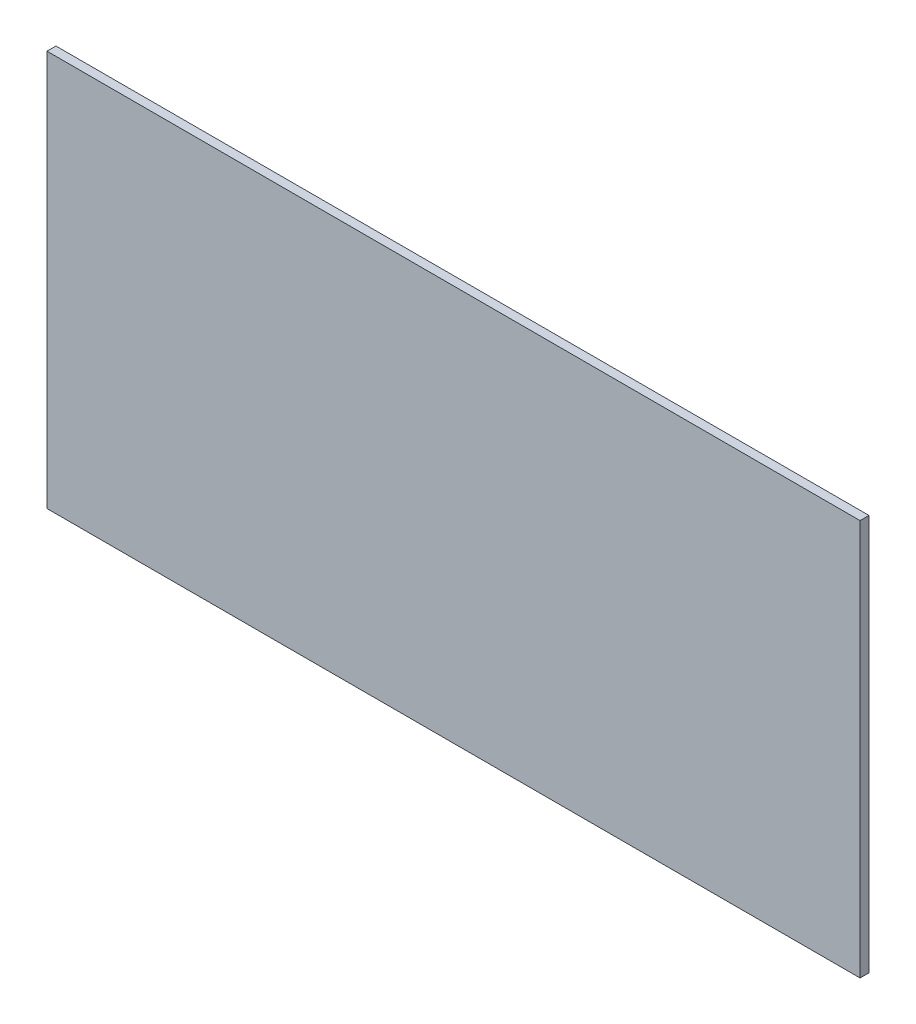
ISO-10303-21;
HEADER;
FILE_DESCRIPTION(('STEP AP214'),'2;1');
FILE_NAME('part.step','',(''),(''),'','','');
FILE_SCHEMA(('AUTOMOTIVE_DESIGN { 1 0 10303 214 1 1 1 1 }'));
ENDSEC;
DATA;
#1=APPLICATION_CONTEXT('core data for automotive mechanical design processes');
#2=APPLICATION_PROTOCOL_DEFINITION('international standard','automotive_design',2000,#1);
#3=PRODUCT_CONTEXT('',#1,'mechanical');
#4=PRODUCT('Part','Part','',(#3));
#5=PRODUCT_RELATED_PRODUCT_CATEGORY('part','',(#4));
#6=PRODUCT_DEFINITION_FORMATION('','',#4);
#7=PRODUCT_DEFINITION_CONTEXT('part definition',#1,'design');
#8=PRODUCT_DEFINITION('design','',#6,#7);
#9=PRODUCT_DEFINITION_SHAPE('','',#8);
#10=(LENGTH_UNIT() NAMED_UNIT(*) SI_UNIT(.MILLI.,.METRE.));
#11=(NAMED_UNIT(*) PLANE_ANGLE_UNIT() SI_UNIT($,.RADIAN.));
#12=(NAMED_UNIT(*) SI_UNIT($,.STERADIAN.) SOLID_ANGLE_UNIT());
#13=UNCERTAINTY_MEASURE_WITH_UNIT(LENGTH_MEASURE(1.E-05),#10,'distance_accuracy_value','');
#14=(GEOMETRIC_REPRESENTATION_CONTEXT(3) GLOBAL_UNCERTAINTY_ASSIGNED_CONTEXT((#13)) GLOBAL_UNIT_ASSIGNED_CONTEXT((#10,
#11,#12)) REPRESENTATION_CONTEXT('',''));
#15=CARTESIAN_POINT('',(0.,0.,0.));
#16=DIRECTION('',(0.,0.,1.));
#17=DIRECTION('',(1.,0.,0.));
#18=AXIS2_PLACEMENT_3D('',#15,#16,#17);
#19=CARTESIAN_POINT('',(-38.0756761891247,29.0300735585592,3.));
#20=DIRECTION('',(1.,0.,0.));
#21=DIRECTION('',(0.,1.,0.));
#22=AXIS2_PLACEMENT_3D('',#19,#20,#21);
#23=PLANE('',#22);
#24=DIRECTION('',(0.,-1.,0.));
#25=VECTOR('',#24,1.);
#26=CARTESIAN_POINT('',(-38.0756761891247,29.0300735585592,0.));
#27=LINE('',#26,#25);
#28=CARTESIAN_POINT('',(-38.0756761891247,29.0300735585592,0.));
#29=VERTEX_POINT('',#28);
#30=CARTESIAN_POINT('',(-38.0756761891247,-103.969926441441,0.));
#31=VERTEX_POINT('',#30);
#32=EDGE_CURVE('E96',#29,#31,#27,.T.);
#33=ORIENTED_EDGE('',*,*,#32,.T.);
#34=DIRECTION('',(0.,0.,-1.));
#35=VECTOR('',#34,1.);
#36=CARTESIAN_POINT('',(-38.0756761891247,-103.969926441441,3.));
#37=LINE('',#36,#35);
#38=CARTESIAN_POINT('',(-38.0756761891247,-103.969926441441,3.));
#39=VERTEX_POINT('',#38);
#40=EDGE_CURVE('E11',#39,#31,#37,.T.);
#41=ORIENTED_EDGE('',*,*,#40,.F.);
#42=DIRECTION('',(0.,-1.,0.));
#43=VECTOR('',#42,1.);
#44=CARTESIAN_POINT('',(-38.0756761891247,29.0300735585592,3.));
#45=LINE('',#44,#43);
#46=CARTESIAN_POINT('',(-38.0756761891247,29.0300735585592,3.));
#47=VERTEX_POINT('',#46);
#48=EDGE_CURVE('E84',#47,#39,#45,.T.);
#49=ORIENTED_EDGE('',*,*,#48,.F.);
#50=DIRECTION('',(0.,0.,-1.));
#51=VECTOR('',#50,1.);
#52=CARTESIAN_POINT('',(-38.0756761891247,29.0300735585592,3.));
#53=LINE('',#52,#51);
#54=EDGE_CURVE('E92',#47,#29,#53,.T.);
#55=ORIENTED_EDGE('',*,*,#54,.T.);
#56=EDGE_LOOP('',(#33,#41,#49,#55));
#57=FACE_BOUND('',#56,.T.);
#58=ADVANCED_FACE('F33',(#57),#23,.F.);
#59=CARTESIAN_POINT('',(-38.0756761891247,-103.969926441441,3.));
#60=DIRECTION('',(0.,1.,0.));
#61=DIRECTION('',(0.,0.,1.));
#62=AXIS2_PLACEMENT_3D('',#59,#60,#61);
#63=PLANE('',#62);
#64=DIRECTION('',(1.,0.,0.));
#65=VECTOR('',#64,1.);
#66=CARTESIAN_POINT('',(-38.0756761891247,-103.969926441441,0.));
#67=LINE('',#66,#65);
#68=CARTESIAN_POINT('',(234.924323810875,-103.969926441441,0.));
#69=VERTEX_POINT('',#68);
#70=EDGE_CURVE('E88',#31,#69,#67,.T.);
#71=ORIENTED_EDGE('',*,*,#70,.T.);
#72=DIRECTION('',(0.,0.,-1.));
#73=VECTOR('',#72,1.);
#74=CARTESIAN_POINT('',(234.924323810875,-103.969926441441,3.));
#75=LINE('',#74,#73);
#76=CARTESIAN_POINT('',(234.924323810875,-103.969926441441,3.));
#77=VERTEX_POINT('',#76);
#78=EDGE_CURVE('E41',#77,#69,#75,.T.);
#79=ORIENTED_EDGE('',*,*,#78,.F.);
#80=DIRECTION('',(1.,0.,0.));
#81=VECTOR('',#80,1.);
#82=CARTESIAN_POINT('',(-38.0756761891247,-103.969926441441,3.));
#83=LINE('',#82,#81);
#84=EDGE_CURVE('E79',#39,#77,#83,.T.);
#85=ORIENTED_EDGE('',*,*,#84,.F.);
#86=ORIENTED_EDGE('',*,*,#40,.T.);
#87=EDGE_LOOP('',(#71,#79,#85,#86));
#88=FACE_BOUND('',#87,.T.);
#89=ADVANCED_FACE('F87',(#88),#63,.F.);
#90=CARTESIAN_POINT('',(234.924323810875,29.0300735585592,3.));
#91=DIRECTION('',(-1.,0.,0.));
#92=DIRECTION('',(0.,0.,1.));
#93=AXIS2_PLACEMENT_3D('',#90,#91,#92);
#94=PLANE('',#93);
#95=DIRECTION('',(0.,1.,0.));
#96=VECTOR('',#95,1.);
#97=CARTESIAN_POINT('',(234.924323810875,29.0300735585592,0.));
#98=LINE('',#97,#96);
#99=CARTESIAN_POINT('',(234.924323810875,29.0300735585592,0.));
#100=VERTEX_POINT('',#99);
#101=EDGE_CURVE('E66',#69,#100,#98,.T.);
#102=ORIENTED_EDGE('',*,*,#101,.T.);
#103=DIRECTION('',(0.,0.,-1.));
#104=VECTOR('',#103,1.);
#105=CARTESIAN_POINT('',(234.924323810875,29.0300735585592,3.));
#106=LINE('',#105,#104);
#107=CARTESIAN_POINT('',(234.924323810875,29.0300735585592,3.));
#108=VERTEX_POINT('',#107);
#109=EDGE_CURVE('E89',#108,#100,#106,.T.);
#110=ORIENTED_EDGE('',*,*,#109,.F.);
#111=DIRECTION('',(0.,1.,0.));
#112=VECTOR('',#111,1.);
#113=CARTESIAN_POINT('',(234.924323810875,29.0300735585592,3.));
#114=LINE('',#113,#112);
#115=EDGE_CURVE('E82',#77,#108,#114,.T.);
#116=ORIENTED_EDGE('',*,*,#115,.F.);
#117=ORIENTED_EDGE('',*,*,#78,.T.);
#118=EDGE_LOOP('',(#102,#110,#116,#117));
#119=FACE_BOUND('',#118,.T.);
#120=ADVANCED_FACE('F90',(#119),#94,.F.);
#121=CARTESIAN_POINT('',(-38.0756761891247,29.0300735585592,3.));
#122=DIRECTION('',(0.,-1.,0.));
#123=DIRECTION('',(0.,0.,-1.));
#124=AXIS2_PLACEMENT_3D('',#121,#122,#123);
#125=PLANE('',#124);
#126=DIRECTION('',(-1.,0.,0.));
#127=VECTOR('',#126,1.);
#128=CARTESIAN_POINT('',(-38.0756761891247,29.0300735585592,0.));
#129=LINE('',#128,#127);
#130=EDGE_CURVE('E72',#100,#29,#129,.T.);
#131=ORIENTED_EDGE('',*,*,#130,.T.);
#132=ORIENTED_EDGE('',*,*,#54,.F.);
#133=DIRECTION('',(-1.,0.,0.));
#134=VECTOR('',#133,1.);
#135=CARTESIAN_POINT('',(-38.0756761891247,29.0300735585592,3.));
#136=LINE('',#135,#134);
#137=EDGE_CURVE('E49',#108,#47,#136,.T.);
#138=ORIENTED_EDGE('',*,*,#137,.F.);
#139=ORIENTED_EDGE('',*,*,#109,.T.);
#140=EDGE_LOOP('',(#131,#132,#138,#139));
#141=FACE_BOUND('',#140,.T.);
#142=ADVANCED_FACE('F103',(#141),#125,.F.);
#143=CARTESIAN_POINT('',(0.,0.,3.));
#144=DIRECTION('',(0.,0.,1.));
#145=DIRECTION('',(1.,0.,0.));
#146=AXIS2_PLACEMENT_3D('',#143,#144,#145);
#147=PLANE('',#146);
#148=ORIENTED_EDGE('',*,*,#48,.T.);
#149=ORIENTED_EDGE('',*,*,#84,.T.);
#150=ORIENTED_EDGE('',*,*,#115,.T.);
#151=ORIENTED_EDGE('',*,*,#137,.T.);
#152=EDGE_LOOP('',(#148,#149,#150,#151));
#153=FACE_BOUND('',#152,.T.);
#154=ADVANCED_FACE('F80',(#153),#147,.T.);
#155=CARTESIAN_POINT('',(0.,0.,0.));
#156=DIRECTION('',(0.,0.,1.));
#157=DIRECTION('',(1.,0.,0.));
#158=AXIS2_PLACEMENT_3D('',#155,#156,#157);
#159=PLANE('',#158);
#160=ORIENTED_EDGE('',*,*,#32,.F.);
#161=ORIENTED_EDGE('',*,*,#130,.F.);
#162=ORIENTED_EDGE('',*,*,#101,.F.);
#163=ORIENTED_EDGE('',*,*,#70,.F.);
#164=EDGE_LOOP('',(#160,#161,#162,#163));
#165=FACE_BOUND('',#164,.T.);
#166=ADVANCED_FACE('F106',(#165),#159,.F.);
#167=CLOSED_SHELL('',(#58,#89,#120,#142,#154,#166));
#168=MANIFOLD_SOLID_BREP('B2',#167);
#169=ADVANCED_BREP_SHAPE_REPRESENTATION('',(#18,#168),#14);
#170=SHAPE_DEFINITION_REPRESENTATION(#9,#169);
ENDSEC;
END-ISO-10303-21;
